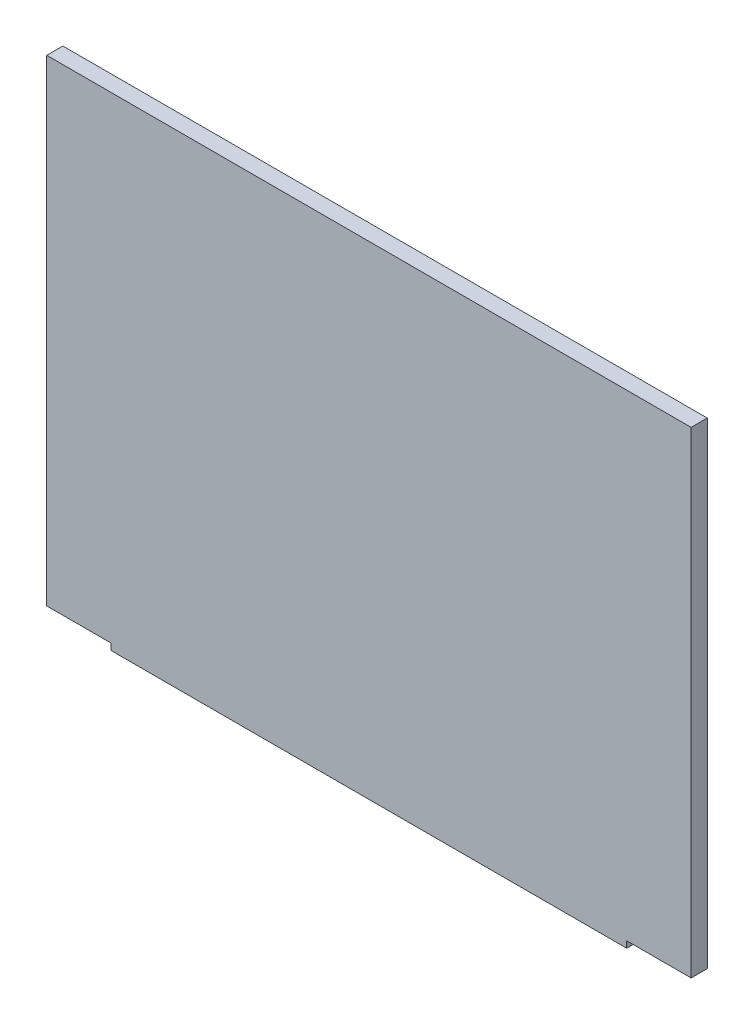
ISO-10303-21;
HEADER;
FILE_DESCRIPTION(('STEP AP214'),'2;1');
FILE_NAME('part.step','',(''),(''),'','','');
FILE_SCHEMA(('AUTOMOTIVE_DESIGN { 1 0 10303 214 1 1 1 1 }'));
ENDSEC;
DATA;
#1=APPLICATION_CONTEXT('core data for automotive mechanical design processes');
#2=APPLICATION_PROTOCOL_DEFINITION('international standard','automotive_design',2000,#1);
#3=PRODUCT_CONTEXT('',#1,'mechanical');
#4=PRODUCT('Part','Part','',(#3));
#5=PRODUCT_RELATED_PRODUCT_CATEGORY('part','',(#4));
#6=PRODUCT_DEFINITION_FORMATION('','',#4);
#7=PRODUCT_DEFINITION_CONTEXT('part definition',#1,'design');
#8=PRODUCT_DEFINITION('design','',#6,#7);
#9=PRODUCT_DEFINITION_SHAPE('','',#8);
#10=(LENGTH_UNIT() NAMED_UNIT(*) SI_UNIT(.MILLI.,.METRE.));
#11=(NAMED_UNIT(*) PLANE_ANGLE_UNIT() SI_UNIT($,.RADIAN.));
#12=(NAMED_UNIT(*) SI_UNIT($,.STERADIAN.) SOLID_ANGLE_UNIT());
#13=UNCERTAINTY_MEASURE_WITH_UNIT(LENGTH_MEASURE(1.E-05),#10,'distance_accuracy_value','');
#14=(GEOMETRIC_REPRESENTATION_CONTEXT(3) GLOBAL_UNCERTAINTY_ASSIGNED_CONTEXT((#13)) GLOBAL_UNIT_ASSIGNED_CONTEXT((#10,
#11,#12)) REPRESENTATION_CONTEXT('',''));
#15=CARTESIAN_POINT('',(0.,0.,0.));
#16=DIRECTION('',(0.,0.,1.));
#17=DIRECTION('',(1.,0.,0.));
#18=AXIS2_PLACEMENT_3D('',#15,#16,#17);
#19=CARTESIAN_POINT('',(-11.0384705813202,6.9811320754717,5.));
#20=DIRECTION('',(1.,0.,0.));
#21=DIRECTION('',(0.,1.,0.));
#22=AXIS2_PLACEMENT_3D('',#19,#20,#21);
#23=PLANE('',#22);
#24=DIRECTION('',(0.,-1.,0.));
#25=VECTOR('',#24,1.);
#26=CARTESIAN_POINT('',(-11.0384705813202,6.9811320754717,0.));
#27=LINE('',#26,#25);
#28=CARTESIAN_POINT('',(-11.0384705813202,6.9811320754717,0.));
#29=VERTEX_POINT('',#28);
#30=CARTESIAN_POINT('',(-11.0384705813202,-141.018867924528,0.));
#31=VERTEX_POINT('',#30);
#32=EDGE_CURVE('E128',#29,#31,#27,.T.);
#33=ORIENTED_EDGE('',*,*,#32,.T.);
#34=DIRECTION('',(0.,0.,1.));
#35=VECTOR('',#34,1.);
#36=CARTESIAN_POINT('',(-11.0384705813202,-141.018867924528,-5.));
#37=LINE('',#36,#35);
#38=CARTESIAN_POINT('',(-11.0384705813202,-141.018867924528,5.));
#39=VERTEX_POINT('',#38);
#40=EDGE_CURVE('E167',#31,#39,#37,.T.);
#41=ORIENTED_EDGE('',*,*,#40,.T.);
#42=DIRECTION('',(0.,-1.,0.));
#43=VECTOR('',#42,1.);
#44=CARTESIAN_POINT('',(-11.0384705813202,6.9811320754717,5.));
#45=LINE('',#44,#43);
#46=CARTESIAN_POINT('',(-11.0384705813202,6.9811320754717,5.));
#47=VERTEX_POINT('',#46);
#48=EDGE_CURVE('E118',#47,#39,#45,.T.);
#49=ORIENTED_EDGE('',*,*,#48,.F.);
#50=DIRECTION('',(0.,0.,-1.));
#51=VECTOR('',#50,1.);
#52=CARTESIAN_POINT('',(-11.0384705813202,6.9811320754717,5.));
#53=LINE('',#52,#51);
#54=EDGE_CURVE('E127',#47,#29,#53,.T.);
#55=ORIENTED_EDGE('',*,*,#54,.T.);
#56=EDGE_LOOP('',(#33,#41,#49,#55));
#57=FACE_BOUND('',#56,.T.);
#58=ADVANCED_FACE('F34',(#57),#23,.F.);
#59=CARTESIAN_POINT('',(188.96152941868,-143.018867924528,5.));
#60=DIRECTION('',(0.,1.,0.));
#61=DIRECTION('',(-1.,0.,0.));
#62=AXIS2_PLACEMENT_3D('',#59,#60,#61);
#63=PLANE('',#62);
#64=DIRECTION('',(1.,0.,0.));
#65=VECTOR('',#64,1.);
#66=CARTESIAN_POINT('',(188.96152941868,-143.018867924528,5.));
#67=LINE('',#66,#65);
#68=CARTESIAN_POINT('',(8.96152941867985,-143.018867924528,5.));
#69=VERTEX_POINT('',#68);
#70=CARTESIAN_POINT('',(168.96152941868,-143.018867924528,5.));
#71=VERTEX_POINT('',#70);
#72=EDGE_CURVE('E110',#69,#71,#67,.T.);
#73=ORIENTED_EDGE('',*,*,#72,.F.);
#74=DIRECTION('',(0.,0.,1.));
#75=VECTOR('',#74,1.);
#76=CARTESIAN_POINT('',(8.96152941867985,-143.018867924528,-5.));
#77=LINE('',#76,#75);
#78=CARTESIAN_POINT('',(8.96152941867985,-143.018867924528,0.));
#79=VERTEX_POINT('',#78);
#80=EDGE_CURVE('E95',#79,#69,#77,.T.);
#81=ORIENTED_EDGE('',*,*,#80,.F.);
#82=DIRECTION('',(1.,0.,0.));
#83=VECTOR('',#82,1.);
#84=CARTESIAN_POINT('',(188.96152941868,-143.018867924528,0.));
#85=LINE('',#84,#83);
#86=CARTESIAN_POINT('',(168.96152941868,-143.018867924528,0.));
#87=VERTEX_POINT('',#86);
#88=EDGE_CURVE('E131',#79,#87,#85,.T.);
#89=ORIENTED_EDGE('',*,*,#88,.T.);
#90=DIRECTION('',(0.,0.,1.));
#91=VECTOR('',#90,1.);
#92=CARTESIAN_POINT('',(168.96152941868,-143.018867924528,-5.));
#93=LINE('',#92,#91);
#94=EDGE_CURVE('E116',#87,#71,#93,.T.);
#95=ORIENTED_EDGE('',*,*,#94,.T.);
#96=EDGE_LOOP('',(#73,#81,#89,#95));
#97=FACE_BOUND('',#96,.T.);
#98=ADVANCED_FACE('F114',(#97),#63,.F.);
#99=CARTESIAN_POINT('',(188.96152941868,6.9811320754717,5.));
#100=DIRECTION('',(-1.,0.,0.));
#101=DIRECTION('',(0.,-1.,0.));
#102=AXIS2_PLACEMENT_3D('',#99,#100,#101);
#103=PLANE('',#102);
#104=DIRECTION('',(0.,1.,0.));
#105=VECTOR('',#104,1.);
#106=CARTESIAN_POINT('',(188.96152941868,6.9811320754717,5.));
#107=LINE('',#106,#105);
#108=CARTESIAN_POINT('',(188.96152941868,-141.018867924528,5.));
#109=VERTEX_POINT('',#108);
#110=CARTESIAN_POINT('',(188.96152941868,6.9811320754717,5.));
#111=VERTEX_POINT('',#110);
#112=EDGE_CURVE('E117',#109,#111,#107,.T.);
#113=ORIENTED_EDGE('',*,*,#112,.F.);
#114=DIRECTION('',(0.,0.,1.));
#115=VECTOR('',#114,1.);
#116=CARTESIAN_POINT('',(188.96152941868,-141.018867924528,-5.));
#117=LINE('',#116,#115);
#118=CARTESIAN_POINT('',(188.96152941868,-141.018867924528,0.));
#119=VERTEX_POINT('',#118);
#120=EDGE_CURVE('E155',#119,#109,#117,.T.);
#121=ORIENTED_EDGE('',*,*,#120,.F.);
#122=DIRECTION('',(0.,1.,0.));
#123=VECTOR('',#122,1.);
#124=CARTESIAN_POINT('',(188.96152941868,6.9811320754717,0.));
#125=LINE('',#124,#123);
#126=CARTESIAN_POINT('',(188.96152941868,6.9811320754717,0.));
#127=VERTEX_POINT('',#126);
#128=EDGE_CURVE('E133',#119,#127,#125,.T.);
#129=ORIENTED_EDGE('',*,*,#128,.T.);
#130=DIRECTION('',(0.,0.,-1.));
#131=VECTOR('',#130,1.);
#132=CARTESIAN_POINT('',(188.96152941868,6.9811320754717,5.));
#133=LINE('',#132,#131);
#134=EDGE_CURVE('E138',#111,#127,#133,.T.);
#135=ORIENTED_EDGE('',*,*,#134,.F.);
#136=EDGE_LOOP('',(#113,#121,#129,#135));
#137=FACE_BOUND('',#136,.T.);
#138=ADVANCED_FACE('F159',(#137),#103,.F.);
#139=CARTESIAN_POINT('',(-11.0384705813202,6.9811320754717,5.));
#140=DIRECTION('',(0.,-1.,0.));
#141=DIRECTION('',(0.,0.,-1.));
#142=AXIS2_PLACEMENT_3D('',#139,#140,#141);
#143=PLANE('',#142);
#144=DIRECTION('',(-1.,0.,0.));
#145=VECTOR('',#144,1.);
#146=CARTESIAN_POINT('',(-11.0384705813202,6.9811320754717,0.));
#147=LINE('',#146,#145);
#148=EDGE_CURVE('E122',#127,#29,#147,.T.);
#149=ORIENTED_EDGE('',*,*,#148,.T.);
#150=ORIENTED_EDGE('',*,*,#54,.F.);
#151=DIRECTION('',(-1.,0.,0.));
#152=VECTOR('',#151,1.);
#153=CARTESIAN_POINT('',(-11.0384705813202,6.9811320754717,5.));
#154=LINE('',#153,#152);
#155=EDGE_CURVE('E120',#111,#47,#154,.T.);
#156=ORIENTED_EDGE('',*,*,#155,.F.);
#157=ORIENTED_EDGE('',*,*,#134,.T.);
#158=EDGE_LOOP('',(#149,#150,#156,#157));
#159=FACE_BOUND('',#158,.T.);
#160=ADVANCED_FACE('F180',(#159),#143,.F.);
#161=CARTESIAN_POINT('',(0.,0.,5.));
#162=DIRECTION('',(0.,0.,-1.));
#163=DIRECTION('',(-1.,0.,0.));
#164=AXIS2_PLACEMENT_3D('',#161,#162,#163);
#165=PLANE('',#164);
#166=ORIENTED_EDGE('',*,*,#48,.T.);
#167=DIRECTION('',(-1.,0.,0.));
#168=VECTOR('',#167,1.);
#169=CARTESIAN_POINT('',(-11.0384705813202,-141.018867924528,5.));
#170=LINE('',#169,#168);
#171=CARTESIAN_POINT('',(8.96152941867985,-141.018867924528,5.));
#172=VERTEX_POINT('',#171);
#173=EDGE_CURVE('E104',#172,#39,#170,.T.);
#174=ORIENTED_EDGE('',*,*,#173,.F.);
#175=DIRECTION('',(0.,1.,0.));
#176=VECTOR('',#175,1.);
#177=CARTESIAN_POINT('',(8.96152941867985,-143.018867924528,5.));
#178=LINE('',#177,#176);
#179=EDGE_CURVE('E98',#69,#172,#178,.T.);
#180=ORIENTED_EDGE('',*,*,#179,.F.);
#181=ORIENTED_EDGE('',*,*,#72,.T.);
#182=DIRECTION('',(0.,-1.,0.));
#183=VECTOR('',#182,1.);
#184=CARTESIAN_POINT('',(168.96152941868,-143.018867924528,5.));
#185=LINE('',#184,#183);
#186=CARTESIAN_POINT('',(168.96152941868,-141.018867924528,5.));
#187=VERTEX_POINT('',#186);
#188=EDGE_CURVE('E161',#187,#71,#185,.T.);
#189=ORIENTED_EDGE('',*,*,#188,.F.);
#190=DIRECTION('',(-1.,0.,0.));
#191=VECTOR('',#190,1.);
#192=CARTESIAN_POINT('',(188.96152941868,-141.018867924528,5.));
#193=LINE('',#192,#191);
#194=EDGE_CURVE('E163',#109,#187,#193,.T.);
#195=ORIENTED_EDGE('',*,*,#194,.F.);
#196=ORIENTED_EDGE('',*,*,#112,.T.);
#197=ORIENTED_EDGE('',*,*,#155,.T.);
#198=EDGE_LOOP('',(#166,#174,#180,#181,#189,#195,#196,#197));
#199=FACE_BOUND('',#198,.T.);
#200=ADVANCED_FACE('F108',(#199),#165,.F.);
#201=CARTESIAN_POINT('',(0.,0.,0.));
#202=DIRECTION('',(0.,0.,-1.));
#203=DIRECTION('',(-1.,0.,0.));
#204=AXIS2_PLACEMENT_3D('',#201,#202,#203);
#205=PLANE('',#204);
#206=DIRECTION('',(1.,0.,0.));
#207=VECTOR('',#206,1.);
#208=CARTESIAN_POINT('',(0.,-141.018867924528,0.));
#209=LINE('',#208,#207);
#210=CARTESIAN_POINT('',(8.96152941867985,-141.018867924528,0.));
#211=VERTEX_POINT('',#210);
#212=EDGE_CURVE('E11',#31,#211,#209,.T.);
#213=ORIENTED_EDGE('',*,*,#212,.F.);
#214=ORIENTED_EDGE('',*,*,#32,.F.);
#215=ORIENTED_EDGE('',*,*,#148,.F.);
#216=ORIENTED_EDGE('',*,*,#128,.F.);
#217=DIRECTION('',(1.,0.,0.));
#218=VECTOR('',#217,1.);
#219=CARTESIAN_POINT('',(0.,-141.018867924528,0.));
#220=LINE('',#219,#218);
#221=CARTESIAN_POINT('',(168.96152941868,-141.018867924528,0.));
#222=VERTEX_POINT('',#221);
#223=EDGE_CURVE('E141',#222,#119,#220,.T.);
#224=ORIENTED_EDGE('',*,*,#223,.F.);
#225=DIRECTION('',(0.,1.,0.));
#226=VECTOR('',#225,1.);
#227=CARTESIAN_POINT('',(168.96152941868,0.,0.));
#228=LINE('',#227,#226);
#229=EDGE_CURVE('E143',#87,#222,#228,.T.);
#230=ORIENTED_EDGE('',*,*,#229,.F.);
#231=ORIENTED_EDGE('',*,*,#88,.F.);
#232=DIRECTION('',(0.,-1.,0.));
#233=VECTOR('',#232,1.);
#234=CARTESIAN_POINT('',(8.96152941867985,0.,0.));
#235=LINE('',#234,#233);
#236=EDGE_CURVE('E41',#211,#79,#235,.T.);
#237=ORIENTED_EDGE('',*,*,#236,.F.);
#238=EDGE_LOOP('',(#213,#214,#215,#216,#224,#230,#231,#237));
#239=FACE_BOUND('',#238,.T.);
#240=ADVANCED_FACE('F151',(#239),#205,.T.);
#241=CARTESIAN_POINT('',(168.96152941868,-143.018867924528,-5.));
#242=DIRECTION('',(-1.,0.,0.));
#243=DIRECTION('',(0.,0.,1.));
#244=AXIS2_PLACEMENT_3D('',#241,#242,#243);
#245=PLANE('',#244);
#246=ORIENTED_EDGE('',*,*,#229,.T.);
#247=DIRECTION('',(0.,0.,1.));
#248=VECTOR('',#247,1.);
#249=CARTESIAN_POINT('',(168.96152941868,-141.018867924528,-5.));
#250=LINE('',#249,#248);
#251=EDGE_CURVE('E55',#222,#187,#250,.T.);
#252=ORIENTED_EDGE('',*,*,#251,.T.);
#253=ORIENTED_EDGE('',*,*,#188,.T.);
#254=ORIENTED_EDGE('',*,*,#94,.F.);
#255=EDGE_LOOP('',(#246,#252,#253,#254));
#256=FACE_BOUND('',#255,.T.);
#257=ADVANCED_FACE('F147',(#256),#245,.F.);
#258=CARTESIAN_POINT('',(188.96152941868,-141.018867924528,-5.));
#259=DIRECTION('',(0.,1.,0.));
#260=DIRECTION('',(0.,0.,1.));
#261=AXIS2_PLACEMENT_3D('',#258,#259,#260);
#262=PLANE('',#261);
#263=ORIENTED_EDGE('',*,*,#223,.T.);
#264=ORIENTED_EDGE('',*,*,#120,.T.);
#265=ORIENTED_EDGE('',*,*,#194,.T.);
#266=ORIENTED_EDGE('',*,*,#251,.F.);
#267=EDGE_LOOP('',(#263,#264,#265,#266));
#268=FACE_BOUND('',#267,.T.);
#269=ADVANCED_FACE('F154',(#268),#262,.F.);
#270=CARTESIAN_POINT('',(-11.0384705813202,-141.018867924528,-5.));
#271=DIRECTION('',(0.,1.,0.));
#272=DIRECTION('',(0.,0.,1.));
#273=AXIS2_PLACEMENT_3D('',#270,#271,#272);
#274=PLANE('',#273);
#275=ORIENTED_EDGE('',*,*,#212,.T.);
#276=DIRECTION('',(0.,0.,1.));
#277=VECTOR('',#276,1.);
#278=CARTESIAN_POINT('',(8.96152941867985,-141.018867924528,-5.));
#279=LINE('',#278,#277);
#280=EDGE_CURVE('E48',#211,#172,#279,.T.);
#281=ORIENTED_EDGE('',*,*,#280,.T.);
#282=ORIENTED_EDGE('',*,*,#173,.T.);
#283=ORIENTED_EDGE('',*,*,#40,.F.);
#284=EDGE_LOOP('',(#275,#281,#282,#283));
#285=FACE_BOUND('',#284,.T.);
#286=ADVANCED_FACE('F173',(#285),#274,.F.);
#287=CARTESIAN_POINT('',(8.96152941867985,-143.018867924528,-5.));
#288=DIRECTION('',(1.,0.,0.));
#289=DIRECTION('',(0.,0.,-1.));
#290=AXIS2_PLACEMENT_3D('',#287,#288,#289);
#291=PLANE('',#290);
#292=ORIENTED_EDGE('',*,*,#236,.T.);
#293=ORIENTED_EDGE('',*,*,#80,.T.);
#294=ORIENTED_EDGE('',*,*,#179,.T.);
#295=ORIENTED_EDGE('',*,*,#280,.F.);
#296=EDGE_LOOP('',(#292,#293,#294,#295));
#297=FACE_BOUND('',#296,.T.);
#298=ADVANCED_FACE('F97',(#297),#291,.F.);
#299=CLOSED_SHELL('',(#58,#98,#138,#160,#200,#240,#257,#269,#286,#298));
#300=MANIFOLD_SOLID_BREP('B2',#299);
#301=ADVANCED_BREP_SHAPE_REPRESENTATION('',(#18,#300),#14);
#302=SHAPE_DEFINITION_REPRESENTATION(#9,#301);
ENDSEC;
END-ISO-10303-21;
